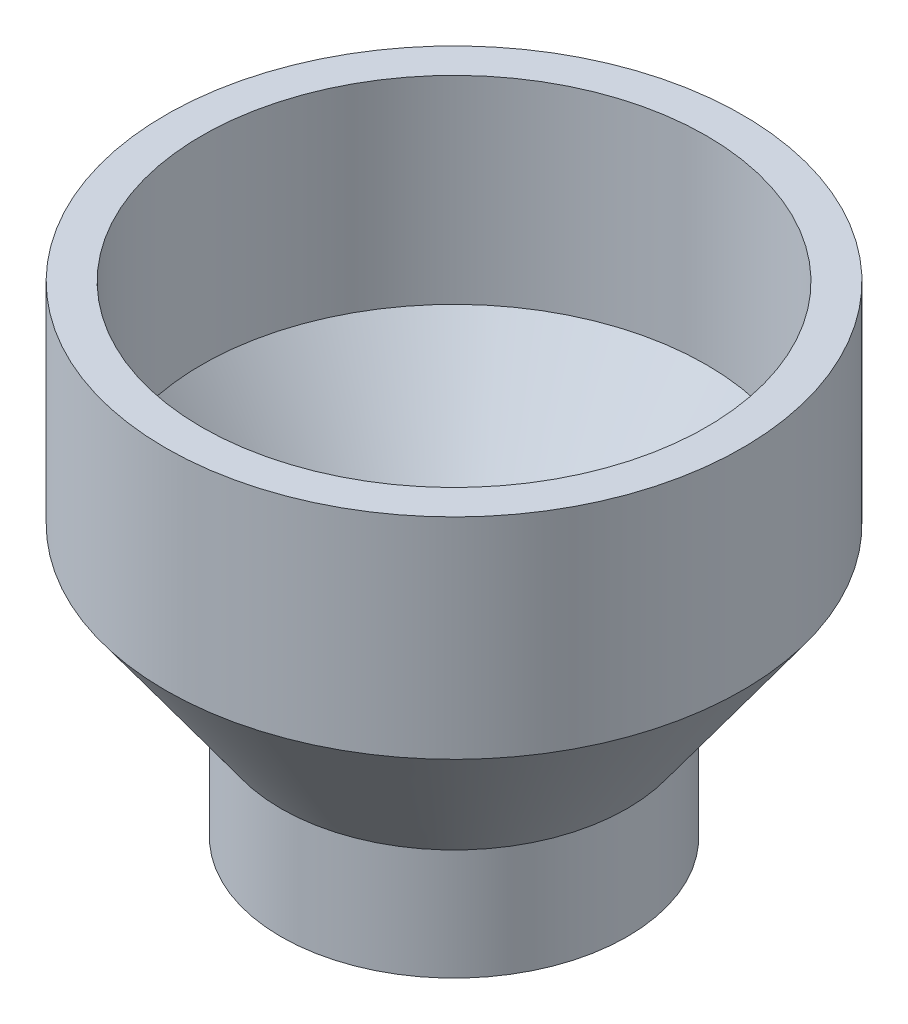
ISO-10303-21;
HEADER;
FILE_DESCRIPTION(('STEP AP214'),'2;1');
FILE_NAME('part.step','',(''),(''),'','','');
FILE_SCHEMA(('AUTOMOTIVE_DESIGN { 1 0 10303 214 1 1 1 1 }'));
ENDSEC;
DATA;
#1=APPLICATION_CONTEXT('core data for automotive mechanical design processes');
#2=APPLICATION_PROTOCOL_DEFINITION('international standard','automotive_design',2000,#1);
#3=PRODUCT_CONTEXT('',#1,'mechanical');
#4=PRODUCT('Part','Part','',(#3));
#5=PRODUCT_RELATED_PRODUCT_CATEGORY('part','',(#4));
#6=PRODUCT_DEFINITION_FORMATION('','',#4);
#7=PRODUCT_DEFINITION_CONTEXT('part definition',#1,'design');
#8=PRODUCT_DEFINITION('design','',#6,#7);
#9=PRODUCT_DEFINITION_SHAPE('','',#8);
#10=(LENGTH_UNIT() NAMED_UNIT(*) SI_UNIT(.MILLI.,.METRE.));
#11=(NAMED_UNIT(*) PLANE_ANGLE_UNIT() SI_UNIT($,.RADIAN.));
#12=(NAMED_UNIT(*) SI_UNIT($,.STERADIAN.) SOLID_ANGLE_UNIT());
#13=UNCERTAINTY_MEASURE_WITH_UNIT(LENGTH_MEASURE(1.E-05),#10,'distance_accuracy_value','');
#14=(GEOMETRIC_REPRESENTATION_CONTEXT(3) GLOBAL_UNCERTAINTY_ASSIGNED_CONTEXT((#13)) GLOBAL_UNIT_ASSIGNED_CONTEXT((#10,
#11,#12)) REPRESENTATION_CONTEXT('',''));
#15=CARTESIAN_POINT('',(0.,0.,0.));
#16=DIRECTION('',(0.,0.,1.));
#17=DIRECTION('',(1.,0.,0.));
#18=AXIS2_PLACEMENT_3D('',#15,#16,#17);
#19=CARTESIAN_POINT('',(0.,0.,0.));
#20=DIRECTION('',(0.,1.,0.));
#21=DIRECTION('',(0.,0.,1.));
#22=AXIS2_PLACEMENT_3D('',#19,#20,#21);
#23=CYLINDRICAL_SURFACE('',#22,44.45);
#24=CARTESIAN_POINT('',(0.,84.709,0.));
#25=DIRECTION('',(0.,1.,0.));
#26=DIRECTION('',(0.,0.,1.));
#27=AXIS2_PLACEMENT_3D('',#24,#25,#26);
#28=CIRCLE('',#27,44.45);
#29=CARTESIAN_POINT('',(0.,84.709,44.45));
#30=VERTEX_POINT('',#29);
#31=EDGE_CURVE('E75',#30,#30,#28,.T.);
#32=ORIENTED_EDGE('',*,*,#31,.T.);
#33=EDGE_LOOP('',(#32));
#34=FACE_BOUND('',#33,.T.);
#35=CARTESIAN_POINT('',(0.,49.784,0.));
#36=DIRECTION('',(0.,1.,0.));
#37=DIRECTION('',(0.,0.,1.));
#38=AXIS2_PLACEMENT_3D('',#35,#36,#37);
#39=CIRCLE('',#38,44.45);
#40=CARTESIAN_POINT('',(0.,49.784,44.45));
#41=VERTEX_POINT('',#40);
#42=EDGE_CURVE('E10',#41,#41,#39,.T.);
#43=ORIENTED_EDGE('',*,*,#42,.F.);
#44=EDGE_LOOP('',(#43));
#45=FACE_BOUND('',#44,.T.);
#46=ADVANCED_FACE('F41',(#34,#45),#23,.F.);
#47=CARTESIAN_POINT('',(0.,21.59,0.));
#48=DIRECTION('',(0.,1.,0.));
#49=DIRECTION('',(0.,0.,1.));
#50=AXIS2_PLACEMENT_3D('',#47,#48,#49);
#51=CONICAL_SURFACE('',#50,24.13,0.624497548789308);
#52=ORIENTED_EDGE('',*,*,#42,.T.);
#53=EDGE_LOOP('',(#52));
#54=FACE_BOUND('',#53,.T.);
#55=CARTESIAN_POINT('',(0.,21.59,0.));
#56=DIRECTION('',(0.,1.,0.));
#57=DIRECTION('',(0.,0.,1.));
#58=AXIS2_PLACEMENT_3D('',#55,#56,#57);
#59=CIRCLE('',#58,24.13);
#60=CARTESIAN_POINT('',(0.,21.59,24.13));
#61=VERTEX_POINT('',#60);
#62=EDGE_CURVE('E48',#61,#61,#59,.T.);
#63=ORIENTED_EDGE('',*,*,#62,.F.);
#64=EDGE_LOOP('',(#63));
#65=FACE_BOUND('',#64,.T.);
#66=ADVANCED_FACE('F113',(#54,#65),#51,.F.);
#67=CARTESIAN_POINT('',(0.,0.,0.));
#68=DIRECTION('',(0.,1.,0.));
#69=DIRECTION('',(0.,0.,1.));
#70=AXIS2_PLACEMENT_3D('',#67,#68,#69);
#71=CYLINDRICAL_SURFACE('',#70,24.13);
#72=ORIENTED_EDGE('',*,*,#62,.T.);
#73=EDGE_LOOP('',(#72));
#74=FACE_BOUND('',#73,.T.);
#75=CARTESIAN_POINT('',(0.,0.,0.));
#76=DIRECTION('',(0.,1.,0.));
#77=DIRECTION('',(0.,0.,1.));
#78=AXIS2_PLACEMENT_3D('',#75,#76,#77);
#79=CIRCLE('',#78,24.13);
#80=CARTESIAN_POINT('',(0.,0.,24.13));
#81=VERTEX_POINT('',#80);
#82=EDGE_CURVE('E54',#81,#81,#79,.T.);
#83=ORIENTED_EDGE('',*,*,#82,.F.);
#84=EDGE_LOOP('',(#83));
#85=FACE_BOUND('',#84,.T.);
#86=ADVANCED_FACE('F108',(#74,#85),#71,.F.);
#87=CARTESIAN_POINT('',(-24.13,0.,0.));
#88=DIRECTION('',(0.,1.,0.));
#89=DIRECTION('',(0.,0.,1.));
#90=AXIS2_PLACEMENT_3D('',#87,#88,#89);
#91=PLANE('',#90);
#92=CARTESIAN_POINT('',(0.,0.,0.));
#93=DIRECTION('',(0.,1.,0.));
#94=DIRECTION('',(0.,0.,1.));
#95=AXIS2_PLACEMENT_3D('',#92,#93,#94);
#96=CIRCLE('',#95,30.48);
#97=CARTESIAN_POINT('',(0.,0.,30.48));
#98=VERTEX_POINT('',#97);
#99=EDGE_CURVE('E60',#98,#98,#96,.T.);
#100=ORIENTED_EDGE('',*,*,#99,.F.);
#101=EDGE_LOOP('',(#100));
#102=FACE_BOUND('',#101,.T.);
#103=ORIENTED_EDGE('',*,*,#82,.T.);
#104=EDGE_LOOP('',(#103));
#105=FACE_BOUND('',#104,.T.);
#106=ADVANCED_FACE('F102',(#102,#105),#91,.F.);
#107=CARTESIAN_POINT('',(0.,0.,0.));
#108=DIRECTION('',(0.,1.,0.));
#109=DIRECTION('',(0.,0.,1.));
#110=AXIS2_PLACEMENT_3D('',#107,#108,#109);
#111=CYLINDRICAL_SURFACE('',#110,30.48);
#112=CARTESIAN_POINT('',(0.,19.5401640111365,0.));
#113=DIRECTION('',(0.,1.,0.));
#114=DIRECTION('',(0.,0.,1.));
#115=AXIS2_PLACEMENT_3D('',#112,#113,#114);
#116=CIRCLE('',#115,30.48);
#117=CARTESIAN_POINT('',(0.,19.5401640111365,30.48));
#118=VERTEX_POINT('',#117);
#119=EDGE_CURVE('E66',#118,#118,#116,.T.);
#120=ORIENTED_EDGE('',*,*,#119,.F.);
#121=EDGE_LOOP('',(#120));
#122=FACE_BOUND('',#121,.T.);
#123=ORIENTED_EDGE('',*,*,#99,.T.);
#124=EDGE_LOOP('',(#123));
#125=FACE_BOUND('',#124,.T.);
#126=ADVANCED_FACE('F96',(#122,#125),#111,.T.);
#127=CARTESIAN_POINT('',(0.,19.5401640111365,0.));
#128=DIRECTION('',(0.,1.,0.));
#129=DIRECTION('',(0.,0.,1.));
#130=AXIS2_PLACEMENT_3D('',#127,#128,#129);
#131=CONICAL_SURFACE('',#130,30.48,0.624497548789308);
#132=CARTESIAN_POINT('',(0.,47.7341640111365,0.));
#133=DIRECTION('',(0.,1.,0.));
#134=DIRECTION('',(0.,0.,1.));
#135=AXIS2_PLACEMENT_3D('',#132,#133,#134);
#136=CIRCLE('',#135,50.8);
#137=CARTESIAN_POINT('',(0.,47.7341640111365,50.8));
#138=VERTEX_POINT('',#137);
#139=EDGE_CURVE('E69',#138,#138,#136,.T.);
#140=ORIENTED_EDGE('',*,*,#139,.F.);
#141=EDGE_LOOP('',(#140));
#142=FACE_BOUND('',#141,.T.);
#143=ORIENTED_EDGE('',*,*,#119,.T.);
#144=EDGE_LOOP('',(#143));
#145=FACE_BOUND('',#144,.T.);
#146=ADVANCED_FACE('F90',(#142,#145),#131,.T.);
#147=CARTESIAN_POINT('',(0.,0.,0.));
#148=DIRECTION('',(0.,1.,0.));
#149=DIRECTION('',(0.,0.,1.));
#150=AXIS2_PLACEMENT_3D('',#147,#148,#149);
#151=CYLINDRICAL_SURFACE('',#150,50.8);
#152=CARTESIAN_POINT('',(0.,84.709,0.));
#153=DIRECTION('',(0.,1.,0.));
#154=DIRECTION('',(0.,0.,1.));
#155=AXIS2_PLACEMENT_3D('',#152,#153,#154);
#156=CIRCLE('',#155,50.8);
#157=CARTESIAN_POINT('',(0.,84.709,50.8));
#158=VERTEX_POINT('',#157);
#159=EDGE_CURVE('E72',#158,#158,#156,.T.);
#160=ORIENTED_EDGE('',*,*,#159,.F.);
#161=EDGE_LOOP('',(#160));
#162=FACE_BOUND('',#161,.T.);
#163=ORIENTED_EDGE('',*,*,#139,.T.);
#164=EDGE_LOOP('',(#163));
#165=FACE_BOUND('',#164,.T.);
#166=ADVANCED_FACE('F84',(#162,#165),#151,.T.);
#167=CARTESIAN_POINT('',(-50.8,84.709,0.));
#168=DIRECTION('',(0.,-1.,0.));
#169=DIRECTION('',(0.,0.,-1.));
#170=AXIS2_PLACEMENT_3D('',#167,#168,#169);
#171=PLANE('',#170);
#172=ORIENTED_EDGE('',*,*,#31,.F.);
#173=EDGE_LOOP('',(#172));
#174=FACE_BOUND('',#173,.T.);
#175=ORIENTED_EDGE('',*,*,#159,.T.);
#176=EDGE_LOOP('',(#175));
#177=FACE_BOUND('',#176,.T.);
#178=ADVANCED_FACE('F81',(#174,#177),#171,.F.);
#179=CLOSED_SHELL('',(#46,#66,#86,#106,#126,#146,#166,#178));
#180=MANIFOLD_SOLID_BREP('B2',#179);
#181=ADVANCED_BREP_SHAPE_REPRESENTATION('',(#18,#180),#14);
#182=SHAPE_DEFINITION_REPRESENTATION(#9,#181);
ENDSEC;
END-ISO-10303-21;
